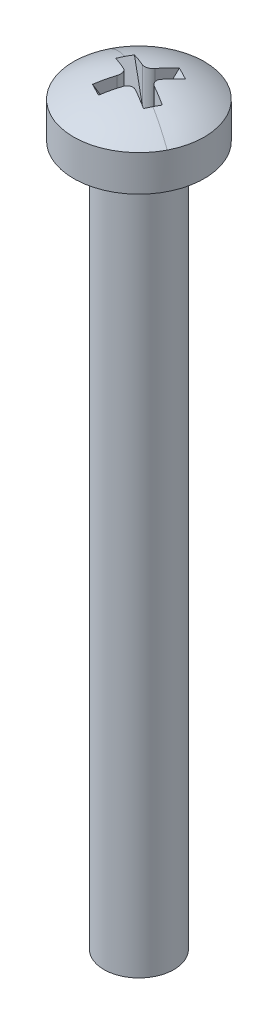
ISO-10303-21;
HEADER;
FILE_DESCRIPTION(('STEP AP214'),'2;1');
FILE_NAME('part.step','',(''),(''),'','','');
FILE_SCHEMA(('AUTOMOTIVE_DESIGN { 1 0 10303 214 1 1 1 1 }'));
ENDSEC;
DATA;
#1=APPLICATION_CONTEXT('core data for automotive mechanical design processes');
#2=APPLICATION_PROTOCOL_DEFINITION('international standard','automotive_design',2000,#1);
#3=PRODUCT_CONTEXT('',#1,'mechanical');
#4=PRODUCT('Part','Part','',(#3));
#5=PRODUCT_RELATED_PRODUCT_CATEGORY('part','',(#4));
#6=PRODUCT_DEFINITION_FORMATION('','',#4);
#7=PRODUCT_DEFINITION_CONTEXT('part definition',#1,'design');
#8=PRODUCT_DEFINITION('design','',#6,#7);
#9=PRODUCT_DEFINITION_SHAPE('','',#8);
#10=(LENGTH_UNIT() NAMED_UNIT(*) SI_UNIT(.MILLI.,.METRE.));
#11=(NAMED_UNIT(*) PLANE_ANGLE_UNIT() SI_UNIT($,.RADIAN.));
#12=(NAMED_UNIT(*) SI_UNIT($,.STERADIAN.) SOLID_ANGLE_UNIT());
#13=UNCERTAINTY_MEASURE_WITH_UNIT(LENGTH_MEASURE(1.E-05),#10,'distance_accuracy_value','');
#14=(GEOMETRIC_REPRESENTATION_CONTEXT(3) GLOBAL_UNCERTAINTY_ASSIGNED_CONTEXT((#13)) GLOBAL_UNIT_ASSIGNED_CONTEXT((#10,
#11,#12)) REPRESENTATION_CONTEXT('',''));
#15=CARTESIAN_POINT('',(0.,0.,0.));
#16=DIRECTION('',(0.,0.,1.));
#17=DIRECTION('',(1.,0.,0.));
#18=AXIS2_PLACEMENT_3D('',#15,#16,#17);
#19=CARTESIAN_POINT('',(-5.7312153497481,45.5704195270786,83.1039085041194));
#20=DIRECTION('',(0.,-1.,0.));
#21=DIRECTION('',(1.,0.,0.));
#22=AXIS2_PLACEMENT_3D('',#19,#20,#21);
#23=PLANE('',#22);
#24=DIRECTION('',(-0.45678408331748,0.,0.889577597080665));
#25=VECTOR('',#24,1.);
#26=CARTESIAN_POINT('',(-5.24871923517746,45.5704195270786,82.6678902764426));
#27=LINE('',#26,#25);
#28=CARTESIAN_POINT('',(-5.24871923517746,45.5704195270786,82.6678902764426));
#29=VERTEX_POINT('',#28);
#30=CARTESIAN_POINT('',(-5.53034360820366,45.5704195270786,83.2163479442678));
#31=VERTEX_POINT('',#30);
#32=EDGE_CURVE('E144',#29,#31,#27,.T.);
#33=ORIENTED_EDGE('',*,*,#32,.F.);
#34=CARTESIAN_POINT('',(-5.05323639563817,45.5704195270786,82.4403238917421));
#35=DIRECTION('',(0.,-1.,0.));
#36=DIRECTION('',(1.,0.,0.));
#37=AXIS2_PLACEMENT_3D('',#34,#35,#36);
#38=CIRCLE('',#37,0.299999999999998);
#39=CARTESIAN_POINT('',(-5.34470545960922,45.5704195270786,82.3692902043266));
#40=VERTEX_POINT('',#39);
#41=EDGE_CURVE('E324',#40,#29,#38,.F.);
#42=ORIENTED_EDGE('',*,*,#41,.F.);
#43=DIRECTION('',(0.889577597080659,0.,0.456784083317492));
#44=VECTOR('',#43,1.);
#45=CARTESIAN_POINT('',(-5.89316312743447,45.5704195270786,82.0876658313004));
#46=LINE('',#45,#44);
#47=CARTESIAN_POINT('',(-5.89316312743446,45.5704195270786,82.0876658313004));
#48=VERTEX_POINT('',#47);
#49=EDGE_CURVE('E170',#48,#40,#46,.T.);
#50=ORIENTED_EDGE('',*,*,#49,.F.);
#51=CARTESIAN_POINT('',(-6.12072951213497,45.5704195270786,81.8921829917611));
#52=DIRECTION('',(0.,-1.,0.));
#53=DIRECTION('',(1.,0.,0.));
#54=AXIS2_PLACEMENT_3D('',#51,#52,#53);
#55=CIRCLE('',#54,0.299999999999998);
#56=CARTESIAN_POINT('',(-6.19176319955046,45.5704195270786,82.1836520557322));
#57=VERTEX_POINT('',#56);
#58=EDGE_CURVE('E342',#57,#48,#55,.F.);
#59=ORIENTED_EDGE('',*,*,#58,.F.);
#60=DIRECTION('',(0.456784083317476,0.,-0.889577597080667));
#61=VECTOR('',#60,1.);
#62=CARTESIAN_POINT('',(-6.47338757257667,45.5704195270786,82.7321097235574));
#63=LINE('',#62,#61);
#64=CARTESIAN_POINT('',(-6.47338757257666,45.5704195270786,82.7321097235574));
#65=VERTEX_POINT('',#64);
#66=EDGE_CURVE('E174',#65,#57,#63,.T.);
#67=ORIENTED_EDGE('',*,*,#66,.F.);
#68=CARTESIAN_POINT('',(-6.66887041211595,45.5704195270786,82.9596761082579));
#69=DIRECTION('',(0.,-1.,0.));
#70=DIRECTION('',(1.,0.,0.));
#71=AXIS2_PLACEMENT_3D('',#68,#69,#70);
#72=CIRCLE('',#71,0.299999999999998);
#73=CARTESIAN_POINT('',(-6.3774013481449,45.5704195270786,83.0307097956734));
#74=VERTEX_POINT('',#73);
#75=EDGE_CURVE('E379',#74,#65,#72,.F.);
#76=ORIENTED_EDGE('',*,*,#75,.F.);
#77=DIRECTION('',(-0.88957759708066,0.,-0.45678408331749));
#78=VECTOR('',#77,1.);
#79=CARTESIAN_POINT('',(-5.82894368031965,45.5704195270786,83.3123341686996));
#80=LINE('',#79,#78);
#81=CARTESIAN_POINT('',(-5.82894368031965,45.5704195270786,83.3123341686996));
#82=VERTEX_POINT('',#81);
#83=EDGE_CURVE('E147',#82,#74,#80,.T.);
#84=ORIENTED_EDGE('',*,*,#83,.F.);
#85=CARTESIAN_POINT('',(-5.60137729561915,45.5704195270786,83.5078170082389));
#86=DIRECTION('',(0.,-1.,0.));
#87=DIRECTION('',(1.,0.,0.));
#88=AXIS2_PLACEMENT_3D('',#85,#86,#87);
#89=CIRCLE('',#88,0.299999999999998);
#90=EDGE_CURVE('E21',#31,#82,#89,.F.);
#91=ORIENTED_EDGE('',*,*,#90,.F.);
#92=EDGE_LOOP('',(#33,#42,#50,#59,#67,#76,#84,#91));
#93=FACE_BOUND('',#92,.T.);
#94=ADVANCED_FACE('F18',(#93),#23,.F.);
#95=CARTESIAN_POINT('',(-5.60137729561915,45.5704195270786,83.5078170082389));
#96=DIRECTION('',(0.,-1.,0.));
#97=DIRECTION('',(1.,0.,0.));
#98=AXIS2_PLACEMENT_3D('',#95,#96,#97);
#99=CYLINDRICAL_SURFACE('',#98,0.299999999999998);
#100=DIRECTION('',(0.,1.,0.));
#101=VECTOR('',#100,1.);
#102=CARTESIAN_POINT('',(-5.86825057474334,45.5704195270786,83.3707817832436));
#103=LINE('',#102,#101);
#104=CARTESIAN_POINT('',(-5.86825057474346,47.2052151838135,83.3707817832439));
#105=VERTEX_POINT('',#104);
#106=CARTESIAN_POINT('',(-5.86825057474334,45.6915738002666,83.3707817832436));
#107=VERTEX_POINT('',#106);
#108=EDGE_CURVE('E471',#105,#107,#103,.F.);
#109=ORIENTED_EDGE('',*,*,#108,.F.);
#110=CARTESIAN_POINT('',(-5.86825057474357,47.2052151838135,83.3707817832441));
#111=CARTESIAN_POINT('',(-5.8606356569211,47.2072391497238,83.3559197222575));
#112=CARTESIAN_POINT('',(-5.85174572056607,47.2090920081056,83.3416898597908));
#113=CARTESIAN_POINT('',(-5.83170765889238,47.2124095103203,83.3148777604995));
#114=CARTESIAN_POINT('',(-5.82056040596617,47.2138743036266,83.30229489024));
#115=CARTESIAN_POINT('',(-5.796283571488,47.2163723024023,83.2791387331639));
#116=CARTESIAN_POINT('',(-5.78315241742198,47.2174051630366,83.2685670556464));
#117=CARTESIAN_POINT('',(-5.75529161487819,47.2190067962014,83.2497616227291));
#118=CARTESIAN_POINT('',(-5.74056249345227,47.2195757212261,83.2415270996949));
#119=CARTESIAN_POINT('',(-5.71004315582194,47.2202300218207,83.2276914439236));
#120=CARTESIAN_POINT('',(-5.69426202632533,47.2203191028308,83.2220704386826));
#121=CARTESIAN_POINT('',(-5.66198923851337,47.2200210020274,83.2135301553134));
#122=CARTESIAN_POINT('',(-5.64549759508667,47.2196338301889,83.2106108206013));
#123=CARTESIAN_POINT('',(-5.61233310136362,47.2183971460226,83.2075563558061));
#124=CARTESIAN_POINT('',(-5.59566103977049,47.2175491814301,83.2074119638093));
#125=CARTESIAN_POINT('',(-5.56255211634217,47.2154168278946,83.2098776194737));
#126=CARTESIAN_POINT('',(-5.54611517161982,47.2141325969105,83.2124866709154));
#127=CARTESIAN_POINT('',(-5.51862531492014,47.2115984533834,83.219216583073));
#128=CARTESIAN_POINT('',(-5.5073967023964,47.2104471601799,83.2226771820593));
#129=CARTESIAN_POINT('',(-5.48545342755952,47.2079631810633,83.2308713279406));
#130=CARTESIAN_POINT('',(-5.47473805166186,47.2066307575083,83.2356030431908));
#131=CARTESIAN_POINT('',(-5.46434207062389,47.2052151838136,83.2409437291147));
#132=B_SPLINE_CURVE_WITH_KNOTS('',3,(#110,#111,#112,#113,#114,#115,#116,#117,#118,#119,#120,
#121,#122,#123,#124,#125,#126,#127,#128,#129,#130,#131),.UNSPECIFIED.,.F.,.F.,(4,2,2,2,2,2,2,2,
2,2,4),(0.,0.0504039946641224,0.100788546583111,0.151213246756512,0.201621365804838,
0.251639660452705,0.301656907488691,0.351507183085324,0.401339428604883,0.436680554237729,
0.47197102490866),.UNSPECIFIED.);
#133=CARTESIAN_POINT('',(-5.4643420706239,47.2052151838136,83.2409437291147));
#134=VERTEX_POINT('',#133);
#135=EDGE_CURVE('E150',#105,#134,#132,.T.);
#136=ORIENTED_EDGE('',*,*,#135,.T.);
#137=DIRECTION('',(0.,1.,0.));
#138=VECTOR('',#137,1.);
#139=CARTESIAN_POINT('',(-5.46434207062391,45.5704195270786,83.2409437291147));
#140=LINE('',#139,#138);
#141=CARTESIAN_POINT('',(-5.46434207062391,45.6915738002666,83.2409437291147));
#142=VERTEX_POINT('',#141);
#143=EDGE_CURVE('E156',#142,#134,#140,.T.);
#144=ORIENTED_EDGE('',*,*,#143,.F.);
#145=CARTESIAN_POINT('',(-5.60137729561915,45.6915738002666,83.5078170082389));
#146=DIRECTION('',(-0.770396797709373,0.500000000000001,-0.395586620197326));
#147=DIRECTION('',(-0.444788798540333,-0.866025403784438,-0.228392041658741));
#148=AXIS2_PLACEMENT_3D('',#145,#146,#147);
#149=ELLIPSE('',#148,0.599999999999995,0.299999999999998);
#150=EDGE_CURVE('E152',#31,#142,#149,.F.);
#151=ORIENTED_EDGE('',*,*,#150,.F.);
#152=ORIENTED_EDGE('',*,*,#90,.T.);
#153=CARTESIAN_POINT('',(-5.60137729561915,45.6915738002666,83.5078170082389));
#154=DIRECTION('',(0.395586620197326,0.500000000000001,-0.770396797709372));
#155=DIRECTION('',(0.228392041658741,-0.866025403784438,-0.444788798540333));
#156=AXIS2_PLACEMENT_3D('',#153,#154,#155);
#157=ELLIPSE('',#156,0.599999999999994,0.299999999999998);
#158=EDGE_CURVE('E179',#107,#82,#157,.F.);
#159=ORIENTED_EDGE('',*,*,#158,.F.);
#160=EDGE_LOOP('',(#109,#136,#144,#151,#152,#159));
#161=FACE_BOUND('',#160,.T.);
#162=ADVANCED_FACE('F154',(#161),#99,.T.);
#163=CARTESIAN_POINT('',(-6.54622952885328,47.2504195270786,84.034366395621));
#164=DIRECTION('',(0.395586620197326,0.500000000000001,-0.770396797709372));
#165=DIRECTION('',(0.,0.838820499650936,0.544408090833847));
#166=AXIS2_PLACEMENT_3D('',#163,#164,#165);
#167=PLANE('',#166);
#168=ORIENTED_EDGE('',*,*,#83,.T.);
#169=CARTESIAN_POINT('',(-6.66887041211595,45.6915738002666,82.9596761082579));
#170=DIRECTION('',(0.395586620197326,0.500000000000001,-0.770396797709372));
#171=DIRECTION('',(0.228392041658741,-0.866025403784438,-0.444788798540333));
#172=AXIS2_PLACEMENT_3D('',#169,#170,#171);
#173=ELLIPSE('',#172,0.599999999999994,0.299999999999998);
#174=CARTESIAN_POINT('',(-6.40199713299174,45.6915738002666,83.0967113332531));
#175=VERTEX_POINT('',#174);
#176=EDGE_CURVE('E178',#175,#74,#173,.T.);
#177=ORIENTED_EDGE('',*,*,#176,.F.);
#178=DIRECTION('',(0.228392041658741,-0.866025403784438,-0.444788798540333));
#179=VECTOR('',#178,1.);
#180=CARTESIAN_POINT('',(-6.75925235532959,47.0462273859704,83.7924585228743));
#181=LINE('',#180,#179);
#182=CARTESIAN_POINT('',(-6.75925235532959,47.0462273859704,83.7924585228743));
#183=VERTEX_POINT('',#182);
#184=EDGE_CURVE('E462',#183,#175,#181,.T.);
#185=ORIENTED_EDGE('',*,*,#184,.F.);
#186=CARTESIAN_POINT('',(-6.7592523553296,47.0462273859704,83.7924585228743));
#187=CARTESIAN_POINT('',(-6.67170762521174,47.0515853639129,83.8408887772387));
#188=CARTESIAN_POINT('',(-6.58345638029879,47.0542643528841,83.8879431085868));
#189=CARTESIAN_POINT('',(-6.40554086088271,47.054264352884,83.9792999252504));
#190=CARTESIAN_POINT('',(-6.31587658637957,47.0515853639128,84.0236024105658));
#191=CARTESIAN_POINT('',(-6.22550579708135,47.0462273859703,84.066528972865));
#192=B_SPLINE_CURVE_WITH_KNOTS('',3,(#186,#187,#188,#189,#190,#191),.UNSPECIFIED.,.F.,.F.,(4,2,
4),(0.,0.30014350531518,0.600287010630361),.UNSPECIFIED.);
#193=CARTESIAN_POINT('',(-6.22550579708127,47.0462273859704,84.0665289728649));
#194=VERTEX_POINT('',#193);
#195=EDGE_CURVE('E384',#183,#194,#192,.T.);
#196=ORIENTED_EDGE('',*,*,#195,.T.);
#197=DIRECTION('',(-0.228392041658738,0.866025403784442,0.444788798540327));
#198=VECTOR('',#197,1.);
#199=CARTESIAN_POINT('',(-5.86825057474334,45.6915738002666,83.3707817832436));
#200=LINE('',#199,#198);
#201=EDGE_CURVE('E468',#107,#194,#200,.T.);
#202=ORIENTED_EDGE('',*,*,#201,.F.);
#203=ORIENTED_EDGE('',*,*,#158,.T.);
#204=EDGE_LOOP('',(#168,#177,#185,#196,#202,#203));
#205=FACE_BOUND('',#204,.T.);
#206=ADVANCED_FACE('F393',(#205),#167,.T.);
#207=CARTESIAN_POINT('',(-6.66887041211595,45.5704195270786,82.9596761082579));
#208=DIRECTION('',(0.,-1.,0.));
#209=DIRECTION('',(1.,0.,0.));
#210=AXIS2_PLACEMENT_3D('',#207,#208,#209);
#211=CYLINDRICAL_SURFACE('',#210,0.299999999999998);
#212=DIRECTION('',(0.,1.,0.));
#213=VECTOR('',#212,1.);
#214=CARTESIAN_POINT('',(-6.53183518712071,45.5704195270786,82.6928028291337));
#215=LINE('',#214,#213);
#216=CARTESIAN_POINT('',(-6.5318351871207,47.2052151838136,82.6928028291337));
#217=VERTEX_POINT('',#216);
#218=CARTESIAN_POINT('',(-6.53183518712071,45.6915738002666,82.6928028291337));
#219=VERTEX_POINT('',#218);
#220=EDGE_CURVE('E459',#217,#219,#215,.F.);
#221=ORIENTED_EDGE('',*,*,#220,.F.);
#222=CARTESIAN_POINT('',(-6.5318351871207,47.2052151838136,82.6928028291337));
#223=CARTESIAN_POINT('',(-6.5169731261341,47.2072391497239,82.7004177469562));
#224=CARTESIAN_POINT('',(-6.50274326366748,47.2090920081056,82.7093076833113));
#225=CARTESIAN_POINT('',(-6.47593116437618,47.2124095103203,82.729345744985));
#226=CARTESIAN_POINT('',(-6.46334829411669,47.2138743036267,82.7404929979112));
#227=CARTESIAN_POINT('',(-6.44019213704063,47.2163723024024,82.7647698323894));
#228=CARTESIAN_POINT('',(-6.42962045952314,47.2174051630366,82.7779009864555));
#229=CARTESIAN_POINT('',(-6.41081502660594,47.2190067962014,82.8057617889993));
#230=CARTESIAN_POINT('',(-6.40258050357175,47.2195757212261,82.8204909104253));
#231=CARTESIAN_POINT('',(-6.38874484780055,47.2202300218208,82.8510102480556));
#232=CARTESIAN_POINT('',(-6.38312384255945,47.2203191028308,82.8667913775522));
#233=CARTESIAN_POINT('',(-6.37458355919038,47.2200210020273,82.8990641653642));
#234=CARTESIAN_POINT('',(-6.37166422447833,47.2196338301889,82.9155558087909));
#235=CARTESIAN_POINT('',(-6.36860975968318,47.2183971460226,82.948720302514));
#236=CARTESIAN_POINT('',(-6.36846536768637,47.2175491814301,82.9653923641071));
#237=CARTESIAN_POINT('',(-6.37093102335083,47.2154168278946,82.9985012875354));
#238=CARTESIAN_POINT('',(-6.37354007479258,47.2141325969105,83.0149382322577));
#239=CARTESIAN_POINT('',(-6.3802699869503,47.2115984533834,83.0424280889574));
#240=CARTESIAN_POINT('',(-6.38373058593661,47.2104471601799,83.0536567014811));
#241=CARTESIAN_POINT('',(-6.39192473181781,47.2079631810633,83.075599976318));
#242=CARTESIAN_POINT('',(-6.39665644706808,47.2066307575083,83.0863153522157));
#243=CARTESIAN_POINT('',(-6.40199713299196,47.2052151838135,83.0967113332536));
#244=B_SPLINE_CURVE_WITH_KNOTS('',3,(#222,#223,#224,#225,#226,#227,#228,#229,#230,#231,#232,
#233,#234,#235,#236,#237,#238,#239,#240,#241,#242,#243),.UNSPECIFIED.,.F.,.F.,(4,2,2,2,2,2,2,2,
2,2,4),(0.,0.0504039946641602,0.100788546583156,0.151213246756544,0.201621365804877,
0.25163966045276,0.301656907488742,0.351507183085344,0.401339428604898,0.436680554237757,
0.471971024908696),.UNSPECIFIED.);
#245=CARTESIAN_POINT('',(-6.40199713299186,47.2052151838135,83.0967113332533));
#246=VERTEX_POINT('',#245);
#247=EDGE_CURVE('E373',#217,#246,#244,.T.);
#248=ORIENTED_EDGE('',*,*,#247,.T.);
#249=DIRECTION('',(0.,1.,0.));
#250=VECTOR('',#249,1.);
#251=CARTESIAN_POINT('',(-6.40199713299174,45.5704195270786,83.0967113332531));
#252=LINE('',#251,#250);
#253=EDGE_CURVE('E465',#175,#246,#252,.T.);
#254=ORIENTED_EDGE('',*,*,#253,.F.);
#255=ORIENTED_EDGE('',*,*,#176,.T.);
#256=ORIENTED_EDGE('',*,*,#75,.T.);
#257=CARTESIAN_POINT('',(-6.66887041211595,45.6915738002666,82.9596761082579));
#258=DIRECTION('',(0.770396797709372,0.500000000000001,0.395586620197326));
#259=DIRECTION('',(0.444788798540333,-0.866025403784438,0.228392041658741));
#260=AXIS2_PLACEMENT_3D('',#257,#258,#259);
#261=ELLIPSE('',#260,0.599999999999994,0.299999999999998);
#262=EDGE_CURVE('E177',#219,#65,#261,.F.);
#263=ORIENTED_EDGE('',*,*,#262,.F.);
#264=EDGE_LOOP('',(#221,#248,#254,#255,#256,#263));
#265=FACE_BOUND('',#264,.T.);
#266=ADVANCED_FACE('F353',(#265),#211,.T.);
#267=CARTESIAN_POINT('',(-7.19541979949806,47.2504195270786,82.0148238750238));
#268=DIRECTION('',(0.770396797709372,0.500000000000001,0.395586620197326));
#269=DIRECTION('',(-0.544408090833847,0.838820499650936,0.));
#270=AXIS2_PLACEMENT_3D('',#267,#268,#269);
#271=PLANE('',#270);
#272=CARTESIAN_POINT('',(-6.12072951213497,45.6915738002666,81.8921829917611));
#273=DIRECTION('',(0.770396797709372,0.500000000000001,0.395586620197326));
#274=DIRECTION('',(0.444788798540333,-0.866025403784438,0.228392041658741));
#275=AXIS2_PLACEMENT_3D('',#272,#273,#274);
#276=ELLIPSE('',#275,0.599999999999994,0.299999999999998);
#277=CARTESIAN_POINT('',(-6.25776473713021,45.6915738002666,82.1590562708853));
#278=VERTEX_POINT('',#277);
#279=EDGE_CURVE('E176',#278,#57,#276,.T.);
#280=ORIENTED_EDGE('',*,*,#279,.F.);
#281=DIRECTION('',(0.444788798540332,-0.86602540378444,0.228392041658738));
#282=VECTOR('',#281,1.);
#283=CARTESIAN_POINT('',(-6.95351192675138,47.0462273859704,81.8018010485475));
#284=LINE('',#283,#282);
#285=CARTESIAN_POINT('',(-6.95351192675138,47.0462273859704,81.8018010485475));
#286=VERTEX_POINT('',#285);
#287=EDGE_CURVE('E450',#286,#278,#284,.T.);
#288=ORIENTED_EDGE('',*,*,#287,.F.);
#289=CARTESIAN_POINT('',(-6.95351192675138,47.0462273859704,81.8018010485475));
#290=CARTESIAN_POINT('',(-6.97770503911477,47.0489060546439,81.8455309450389));
#291=CARTESIAN_POINT('',(-7.00156517813349,47.0509151362235,81.8894587045128));
#292=CARTESIAN_POINT('',(-7.04861950948159,47.0535941251947,81.9777099494258));
#293=CARTESIAN_POINT('',(-7.07181370181097,47.0542640325863,82.0220334348648));
#294=CARTESIAN_POINT('',(-7.09467492079568,47.054264352884,82.0665547832863));
#295=B_SPLINE_CURVE_WITH_KNOTS('',3,(#289,#290,#291,#292,#293,#294),.UNSPECIFIED.,.F.,.F.,(4,2,
4),(0.,0.150089694038869,0.300179388077748),.UNSPECIFIED.);
#296=CARTESIAN_POINT('',(-7.09467492079568,47.054264352884,82.0665547832863));
#297=VERTEX_POINT('',#296);
#298=EDGE_CURVE('E366',#286,#297,#295,.T.);
#299=ORIENTED_EDGE('',*,*,#298,.T.);
#300=CARTESIAN_POINT('',(-7.09467492079568,47.054264352884,82.0665547832863));
#301=CARTESIAN_POINT('',(-7.11753581077196,47.0542640325864,82.1110763006485));
#302=CARTESIAN_POINT('',(-7.14004187708895,47.0535941251947,82.1557531279554));
#303=CARTESIAN_POINT('',(-7.18434436240436,47.0509151362235,82.2454174024586));
#304=CARTESIAN_POINT('',(-7.20614078140278,47.0489060546439,82.2904048496548));
#305=CARTESIAN_POINT('',(-7.22758237674191,47.0462273859704,82.3355476067958));
#306=B_SPLINE_CURVE_WITH_KNOTS('',3,(#300,#301,#302,#303,#304,#305),.UNSPECIFIED.,.F.,.F.,(4,2,
4),(0.,0.150089694038871,0.30017938807773),.UNSPECIFIED.);
#307=CARTESIAN_POINT('',(-7.22758237674189,47.0462273859704,82.3355476067958));
#308=VERTEX_POINT('',#307);
#309=EDGE_CURVE('E359',#297,#308,#306,.T.);
#310=ORIENTED_EDGE('',*,*,#309,.T.);
#311=DIRECTION('',(-0.444788798540329,0.866025403784441,-0.228392041658738));
#312=VECTOR('',#311,1.);
#313=CARTESIAN_POINT('',(-6.53183518712071,45.6915738002666,82.6928028291337));
#314=LINE('',#313,#312);
#315=EDGE_CURVE('E456',#219,#308,#314,.T.);
#316=ORIENTED_EDGE('',*,*,#315,.F.);
#317=ORIENTED_EDGE('',*,*,#262,.T.);
#318=ORIENTED_EDGE('',*,*,#66,.T.);
#319=EDGE_LOOP('',(#280,#288,#299,#310,#316,#317,#318));
#320=FACE_BOUND('',#319,.T.);
#321=ADVANCED_FACE('F348',(#320),#271,.T.);
#322=CARTESIAN_POINT('',(-6.12072951213497,45.5704195270786,81.8921829917611));
#323=DIRECTION('',(0.,-1.,0.));
#324=DIRECTION('',(1.,0.,0.));
#325=AXIS2_PLACEMENT_3D('',#322,#323,#324);
#326=CYLINDRICAL_SURFACE('',#325,0.299999999999998);
#327=DIRECTION('',(0.,1.,0.));
#328=VECTOR('',#327,1.);
#329=CARTESIAN_POINT('',(-5.85385623301077,45.5704195270786,82.0292182167563));
#330=LINE('',#329,#328);
#331=CARTESIAN_POINT('',(-5.85385623301066,47.2052151838135,82.0292182167561));
#332=VERTEX_POINT('',#331);
#333=CARTESIAN_POINT('',(-5.85385623301077,45.6915738002666,82.0292182167563));
#334=VERTEX_POINT('',#333);
#335=EDGE_CURVE('E447',#332,#334,#330,.F.);
#336=ORIENTED_EDGE('',*,*,#335,.F.);
#337=CARTESIAN_POINT('',(-5.85385623301054,47.2052151838135,82.0292182167559));
#338=CARTESIAN_POINT('',(-5.86147115083302,47.2072391497238,82.0440802777425));
#339=CARTESIAN_POINT('',(-5.87036108718805,47.2090920081056,82.0583101402092));
#340=CARTESIAN_POINT('',(-5.89039914886175,47.2124095103203,82.0851222395005));
#341=CARTESIAN_POINT('',(-5.90154640178795,47.2138743036267,82.09770510976));
#342=CARTESIAN_POINT('',(-5.92582323626612,47.2163723024023,82.1208612668361));
#343=CARTESIAN_POINT('',(-5.93895439033213,47.2174051630366,82.1314329443536));
#344=CARTESIAN_POINT('',(-5.96681519287594,47.2190067962014,82.1502383772708));
#345=CARTESIAN_POINT('',(-5.98154431430189,47.2195757212261,82.158472900305));
#346=CARTESIAN_POINT('',(-6.01206365193223,47.2202300218207,82.1723085560763));
#347=CARTESIAN_POINT('',(-6.02784478142883,47.2203191028308,82.1779295613174));
#348=CARTESIAN_POINT('',(-6.06011756924077,47.2200210020274,82.1864698446866));
#349=CARTESIAN_POINT('',(-6.07660921266747,47.2196338301889,82.1893891793987));
#350=CARTESIAN_POINT('',(-6.10977370639052,47.2183971460226,82.1924436441939));
#351=CARTESIAN_POINT('',(-6.12644576798365,47.2175491814301,82.1925880361907));
#352=CARTESIAN_POINT('',(-6.15955469141196,47.2154168278946,82.1901223805263));
#353=CARTESIAN_POINT('',(-6.17599163613431,47.2141325969105,82.1875133290846));
#354=CARTESIAN_POINT('',(-6.20348149283399,47.2115984533834,82.1807834169269));
#355=CARTESIAN_POINT('',(-6.21471010535773,47.2104471601799,82.1773228179406));
#356=CARTESIAN_POINT('',(-6.23665338019461,47.2079631810633,82.1691286720595));
#357=CARTESIAN_POINT('',(-6.24736875609226,47.2066307575083,82.1643969568092));
#358=CARTESIAN_POINT('',(-6.25776473713021,47.2052151838136,82.1590562708853));
#359=B_SPLINE_CURVE_WITH_KNOTS('',3,(#337,#338,#339,#340,#341,#342,#343,#344,#345,#346,#347,
#348,#349,#350,#351,#352,#353,#354,#355,#356,#357,#358),.UNSPECIFIED.,.F.,.F.,(4,2,2,2,2,2,2,2,
2,2,4),(0.,0.0504039946641595,0.100788546583139,0.151213246756522,0.201621365804842,
0.251639660452726,0.301656907488703,0.351507183085331,0.401339428604902,0.436680554237732,
0.471971024908636),.UNSPECIFIED.);
#360=CARTESIAN_POINT('',(-6.2577647371302,47.2052151838136,82.1590562708853));
#361=VERTEX_POINT('',#360);
#362=EDGE_CURVE('E336',#332,#361,#359,.T.);
#363=ORIENTED_EDGE('',*,*,#362,.T.);
#364=DIRECTION('',(0.,1.,0.));
#365=VECTOR('',#364,1.);
#366=CARTESIAN_POINT('',(-6.25776473713021,45.5704195270786,82.1590562708853));
#367=LINE('',#366,#365);
#368=EDGE_CURVE('E453',#278,#361,#367,.T.);
#369=ORIENTED_EDGE('',*,*,#368,.F.);
#370=ORIENTED_EDGE('',*,*,#279,.T.);
#371=ORIENTED_EDGE('',*,*,#58,.T.);
#372=CARTESIAN_POINT('',(-6.12072951213497,45.6915738002666,81.8921829917611));
#373=DIRECTION('',(-0.395586620197326,0.500000000000001,0.770396797709372));
#374=DIRECTION('',(-0.228392041658741,-0.866025403784438,0.444788798540333));
#375=AXIS2_PLACEMENT_3D('',#372,#373,#374);
#376=ELLIPSE('',#375,0.599999999999995,0.299999999999998);
#377=EDGE_CURVE('E173',#334,#48,#376,.F.);
#378=ORIENTED_EDGE('',*,*,#377,.F.);
#379=EDGE_LOOP('',(#336,#363,#369,#370,#371,#378));
#380=FACE_BOUND('',#379,.T.);
#381=ADVANCED_FACE('F344',(#380),#326,.T.);
#382=CARTESIAN_POINT('',(-5.17587727890084,47.2504195270786,81.365633604379));
#383=DIRECTION('',(-0.395586620197326,0.500000000000001,0.770396797709372));
#384=DIRECTION('',(0.,-0.838820499650936,0.544408090833847));
#385=AXIS2_PLACEMENT_3D('',#382,#383,#384);
#386=PLANE('',#385);
#387=ORIENTED_EDGE('',*,*,#49,.T.);
#388=CARTESIAN_POINT('',(-5.05323639563817,45.6915738002666,82.4403238917421));
#389=DIRECTION('',(-0.395586620197326,0.500000000000001,0.770396797709372));
#390=DIRECTION('',(-0.228392041658741,-0.866025403784438,0.444788798540333));
#391=AXIS2_PLACEMENT_3D('',#388,#389,#390);
#392=ELLIPSE('',#391,0.599999999999995,0.299999999999998);
#393=CARTESIAN_POINT('',(-5.32010967476237,45.6915738002666,82.3032886667468));
#394=VERTEX_POINT('',#393);
#395=EDGE_CURVE('E172',#394,#40,#392,.T.);
#396=ORIENTED_EDGE('',*,*,#395,.F.);
#397=DIRECTION('',(-0.228392041658737,-0.866025403784442,0.444788798540327));
#398=VECTOR('',#397,1.);
#399=CARTESIAN_POINT('',(-4.96285445242453,47.0462273859704,81.6075414771257));
#400=LINE('',#399,#398);
#401=CARTESIAN_POINT('',(-4.96285445242452,47.0462273859704,81.6075414771257));
#402=VERTEX_POINT('',#401);
#403=EDGE_CURVE('E438',#402,#394,#400,.T.);
#404=ORIENTED_EDGE('',*,*,#403,.F.);
#405=CARTESIAN_POINT('',(-4.96285445242452,47.0462273859704,81.6075414771257));
#406=CARTESIAN_POINT('',(-5.05039918254237,47.0515853639128,81.5591112227613));
#407=CARTESIAN_POINT('',(-5.13865042745532,47.0542643528841,81.5120568914132));
#408=CARTESIAN_POINT('',(-5.3165659468714,47.054264352884,81.4207000747496));
#409=CARTESIAN_POINT('',(-5.40623022137454,47.0515853639128,81.3763975894341));
#410=CARTESIAN_POINT('',(-5.49660101067277,47.0462273859703,81.333471027135));
#411=B_SPLINE_CURVE_WITH_KNOTS('',3,(#405,#406,#407,#408,#409,#410),.UNSPECIFIED.,.F.,.F.,(4,2,
4),(0.,0.300143505315175,0.600287010630354),.UNSPECIFIED.);
#412=CARTESIAN_POINT('',(-5.49660101067284,47.0462273859704,81.3334710271351));
#413=VERTEX_POINT('',#412);
#414=EDGE_CURVE('E330',#402,#413,#411,.T.);
#415=ORIENTED_EDGE('',*,*,#414,.T.);
#416=DIRECTION('',(0.228392041658741,0.866025403784438,-0.444788798540333));
#417=VECTOR('',#416,1.);
#418=CARTESIAN_POINT('',(-5.85385623301077,45.6915738002666,82.0292182167563));
#419=LINE('',#418,#417);
#420=EDGE_CURVE('E444',#334,#413,#419,.T.);
#421=ORIENTED_EDGE('',*,*,#420,.F.);
#422=ORIENTED_EDGE('',*,*,#377,.T.);
#423=EDGE_LOOP('',(#387,#396,#404,#415,#421,#422));
#424=FACE_BOUND('',#423,.T.);
#425=ADVANCED_FACE('F314',(#424),#386,.T.);
#426=CARTESIAN_POINT('',(-5.05323639563817,45.5704195270786,82.4403238917421));
#427=DIRECTION('',(0.,-1.,0.));
#428=DIRECTION('',(1.,0.,0.));
#429=AXIS2_PLACEMENT_3D('',#426,#427,#428);
#430=CYLINDRICAL_SURFACE('',#429,0.299999999999998);
#431=DIRECTION('',(0.,1.,0.));
#432=VECTOR('',#431,1.);
#433=CARTESIAN_POINT('',(-5.19027162063341,45.5704195270786,82.7071971708663));
#434=LINE('',#433,#432);
#435=CARTESIAN_POINT('',(-5.19027162063341,47.2052151838136,82.7071971708663));
#436=VERTEX_POINT('',#435);
#437=CARTESIAN_POINT('',(-5.19027162063341,45.6915738002666,82.7071971708663));
#438=VERTEX_POINT('',#437);
#439=EDGE_CURVE('E435',#436,#438,#434,.F.);
#440=ORIENTED_EDGE('',*,*,#439,.F.);
#441=CARTESIAN_POINT('',(-5.19027162063341,47.2052151838136,82.7071971708663));
#442=CARTESIAN_POINT('',(-5.20513368161999,47.2072391497239,82.6995822530438));
#443=CARTESIAN_POINT('',(-5.21936354408661,47.2090920081056,82.6906923166887));
#444=CARTESIAN_POINT('',(-5.24617564337793,47.2124095103203,82.670654255015));
#445=CARTESIAN_POINT('',(-5.25875851363742,47.2138743036267,82.6595070020888));
#446=CARTESIAN_POINT('',(-5.28191467071348,47.2163723024024,82.6352301676106));
#447=CARTESIAN_POINT('',(-5.29248634823096,47.2174051630366,82.6220990135445));
#448=CARTESIAN_POINT('',(-5.31129178114815,47.2190067962014,82.5942382110007));
#449=CARTESIAN_POINT('',(-5.31952630418234,47.2195757212261,82.5795090895747));
#450=CARTESIAN_POINT('',(-5.33336195995354,47.2202300218207,82.5489897519444));
#451=CARTESIAN_POINT('',(-5.33898296519464,47.2203191028308,82.5332086224478));
#452=CARTESIAN_POINT('',(-5.34752324856373,47.2200210020273,82.5009358346358));
#453=CARTESIAN_POINT('',(-5.35044258327578,47.2196338301889,82.4844441912091));
#454=CARTESIAN_POINT('',(-5.35349704807093,47.2183971460226,82.4512796974861));
#455=CARTESIAN_POINT('',(-5.35364144006775,47.2175491814301,82.434607635893));
#456=CARTESIAN_POINT('',(-5.3511757844033,47.2154168278946,82.4014987124646));
#457=CARTESIAN_POINT('',(-5.34856673296156,47.2141325969105,82.3850617677423));
#458=CARTESIAN_POINT('',(-5.34183682080385,47.2115984533834,82.3575719110426));
#459=CARTESIAN_POINT('',(-5.33837622181754,47.2104471601799,82.3463432985189));
#460=CARTESIAN_POINT('',(-5.33018207593632,47.2079631810633,82.324400023682));
#461=CARTESIAN_POINT('',(-5.32545036068604,47.2066307575083,82.3136846477844));
#462=CARTESIAN_POINT('',(-5.32010967476215,47.2052151838135,82.3032886667464));
#463=B_SPLINE_CURVE_WITH_KNOTS('',3,(#441,#442,#443,#444,#445,#446,#447,#448,#449,#450,#451,
#452,#453,#454,#455,#456,#457,#458,#459,#460,#461,#462),.UNSPECIFIED.,.F.,.F.,(4,2,2,2,2,2,2,2,
2,2,4),(0.,0.0504039946641485,0.100788546583122,0.151213246756523,0.201621365804828,
0.251639660452688,0.301656907488673,0.351507183085301,0.401339428604868,0.436680554237714,
0.471971024908639),.UNSPECIFIED.);
#464=CARTESIAN_POINT('',(-5.32010967476226,47.2052151838135,82.3032886667466));
#465=VERTEX_POINT('',#464);
#466=EDGE_CURVE('E318',#436,#465,#463,.T.);
#467=ORIENTED_EDGE('',*,*,#466,.T.);
#468=DIRECTION('',(0.,1.,0.));
#469=VECTOR('',#468,1.);
#470=CARTESIAN_POINT('',(-5.32010967476237,45.5704195270786,82.3032886667468));
#471=LINE('',#470,#469);
#472=EDGE_CURVE('E441',#394,#465,#471,.T.);
#473=ORIENTED_EDGE('',*,*,#472,.F.);
#474=ORIENTED_EDGE('',*,*,#395,.T.);
#475=ORIENTED_EDGE('',*,*,#41,.T.);
#476=CARTESIAN_POINT('',(-5.05323639563817,45.6915738002666,82.4403238917421));
#477=DIRECTION('',(-0.770396797709373,0.500000000000001,-0.395586620197326));
#478=DIRECTION('',(-0.444788798540333,-0.866025403784438,-0.228392041658741));
#479=AXIS2_PLACEMENT_3D('',#476,#477,#478);
#480=ELLIPSE('',#479,0.599999999999995,0.299999999999998);
#481=EDGE_CURVE('E163',#438,#29,#480,.F.);
#482=ORIENTED_EDGE('',*,*,#481,.F.);
#483=EDGE_LOOP('',(#440,#467,#473,#474,#475,#482));
#484=FACE_BOUND('',#483,.T.);
#485=ADVANCED_FACE('F309',(#484),#430,.T.);
#486=CARTESIAN_POINT('',(-4.52668700825606,47.2504195270786,83.3851761249762));
#487=DIRECTION('',(-0.770396797709373,0.500000000000001,-0.395586620197326));
#488=DIRECTION('',(-0.544408090833847,-0.838820499650936,0.));
#489=AXIS2_PLACEMENT_3D('',#486,#487,#488);
#490=PLANE('',#489);
#491=ORIENTED_EDGE('',*,*,#150,.T.);
#492=DIRECTION('',(-0.444788798540329,-0.866025403784441,-0.228392041658738));
#493=VECTOR('',#492,1.);
#494=CARTESIAN_POINT('',(-4.76859488100274,47.0462273859704,83.5981989514525));
#495=LINE('',#494,#493);
#496=CARTESIAN_POINT('',(-4.76859488100274,47.0462273859704,83.5981989514525));
#497=VERTEX_POINT('',#496);
#498=EDGE_CURVE('E473',#497,#142,#495,.T.);
#499=ORIENTED_EDGE('',*,*,#498,.F.);
#500=CARTESIAN_POINT('',(-4.76859488100274,47.0462273859704,83.5981989514525));
#501=CARTESIAN_POINT('',(-4.74440176863934,47.0489060546439,83.5544690549611));
#502=CARTESIAN_POINT('',(-4.72054162962062,47.0509151362235,83.5105412954872));
#503=CARTESIAN_POINT('',(-4.67348729827252,47.0535941251947,83.4222900505742));
#504=CARTESIAN_POINT('',(-4.65029310594315,47.0542640325864,83.3779665651352));
#505=CARTESIAN_POINT('',(-4.62743188695845,47.054264352884,83.3334452167137));
#506=B_SPLINE_CURVE_WITH_KNOTS('',3,(#500,#501,#502,#503,#504,#505),.UNSPECIFIED.,.F.,.F.,(4,2,
4),(0.,0.150089694038875,0.300179388077759),.UNSPECIFIED.);
#507=CARTESIAN_POINT('',(-4.62743188695846,47.054264352884,83.3334452167137));
#508=VERTEX_POINT('',#507);
#509=EDGE_CURVE('E300',#497,#508,#506,.T.);
#510=ORIENTED_EDGE('',*,*,#509,.T.);
#511=CARTESIAN_POINT('',(-4.62743188695846,47.054264352884,83.3334452167137));
#512=CARTESIAN_POINT('',(-4.60457099698217,47.0542640325864,83.2889236993515));
#513=CARTESIAN_POINT('',(-4.58206493066517,47.0535941251947,83.2442468720446));
#514=CARTESIAN_POINT('',(-4.53776244534976,47.0509151362235,83.1545825975414));
#515=CARTESIAN_POINT('',(-4.51596602635135,47.0489060546439,83.1095951503451));
#516=CARTESIAN_POINT('',(-4.49452443101222,47.0462273859704,83.0644523932041));
#517=B_SPLINE_CURVE_WITH_KNOTS('',3,(#511,#512,#513,#514,#515,#516),.UNSPECIFIED.,.F.,.F.,(4,2,
4),(0.,0.15008969403889,0.300179388077773),.UNSPECIFIED.);
#518=CARTESIAN_POINT('',(-4.49452443101224,47.0462273859704,83.0644523932041));
#519=VERTEX_POINT('',#518);
#520=EDGE_CURVE('E165',#508,#519,#517,.T.);
#521=ORIENTED_EDGE('',*,*,#520,.T.);
#522=DIRECTION('',(0.444788798540327,0.866025403784442,0.228392041658738));
#523=VECTOR('',#522,1.);
#524=CARTESIAN_POINT('',(-5.19027162063341,45.6915738002666,82.7071971708663));
#525=LINE('',#524,#523);
#526=EDGE_CURVE('E293',#438,#519,#525,.T.);
#527=ORIENTED_EDGE('',*,*,#526,.F.);
#528=ORIENTED_EDGE('',*,*,#481,.T.);
#529=ORIENTED_EDGE('',*,*,#32,.T.);
#530=EDGE_LOOP('',(#491,#499,#510,#521,#527,#528,#529));
#531=FACE_BOUND('',#530,.T.);
#532=ADVANCED_FACE('F161',(#531),#490,.T.);
#533=CARTESIAN_POINT('',(-5.7312153497481,45.5704195270786,83.1039085041194));
#534=DIRECTION('',(0.456784083317481,0.,-0.889577597080664));
#535=DIRECTION('',(-0.889577597080664,0.,-0.456784083317481));
#536=AXIS2_PLACEMENT_3D('',#533,#534,#535);
#537=PLANE('',#536);
#538=CARTESIAN_POINT('',(-4.76859488100275,47.0462273859704,83.5981989514526));
#539=CARTESIAN_POINT('',(-4.88266503436871,47.0831642737427,83.5396257245523));
#540=CARTESIAN_POINT('',(-4.99767904352011,47.1148817007824,83.4805678425741));
#541=CARTESIAN_POINT('',(-5.22959477339383,47.1678776333968,83.3614827684614));
#542=CARTESIAN_POINT('',(-5.34649649411614,47.1891561389715,83.3014555763271));
#543=CARTESIAN_POINT('',(-5.4643420706239,47.2052151838136,83.2409437291147));
#544=B_SPLINE_CURVE_WITH_KNOTS('',3,(#538,#539,#540,#541,#542,#543),.UNSPECIFIED.,.F.,.F.,(4,2,
4),(0.,0.399372580588287,0.798745161176576),.UNSPECIFIED.);
#545=EDGE_CURVE('E287',#497,#134,#544,.T.);
#546=ORIENTED_EDGE('',*,*,#545,.F.);
#547=ORIENTED_EDGE('',*,*,#498,.T.);
#548=ORIENTED_EDGE('',*,*,#143,.T.);
#549=EDGE_LOOP('',(#546,#547,#548));
#550=FACE_BOUND('',#549,.T.);
#551=ADVANCED_FACE('F276',(#550),#537,.T.);
#552=CARTESIAN_POINT('',(-5.7312153497481,45.5704195270786,83.1039085041194));
#553=DIRECTION('',(-0.889577597080664,0.,-0.456784083317481));
#554=DIRECTION('',(-0.456784083317481,0.,0.889577597080664));
#555=AXIS2_PLACEMENT_3D('',#552,#553,#554);
#556=PLANE('',#555);
#557=ORIENTED_EDGE('',*,*,#201,.T.);
#558=CARTESIAN_POINT('',(-5.86825057474357,47.2052151838135,83.3707817832441));
#559=CARTESIAN_POINT('',(-5.92876242195592,47.1891561389714,83.4886273597517));
#560=CARTESIAN_POINT('',(-5.98878961409023,47.1678776333968,83.605529080474));
#561=CARTESIAN_POINT('',(-6.10787468820276,47.1148817007824,83.8374448103475));
#562=CARTESIAN_POINT('',(-6.16693257018097,47.0831642737427,83.9524588194988));
#563=CARTESIAN_POINT('',(-6.22550579708115,47.0462273859705,84.0665289728647));
#564=B_SPLINE_CURVE_WITH_KNOTS('',3,(#558,#559,#560,#561,#562,#563),.UNSPECIFIED.,.F.,.F.,(4,2,
4),(0.,0.399372580588009,0.798745161175991),.UNSPECIFIED.);
#565=EDGE_CURVE('E280',#105,#194,#564,.T.);
#566=ORIENTED_EDGE('',*,*,#565,.F.);
#567=ORIENTED_EDGE('',*,*,#108,.T.);
#568=EDGE_LOOP('',(#557,#566,#567));
#569=FACE_BOUND('',#568,.T.);
#570=ADVANCED_FACE('F271',(#569),#556,.T.);
#571=CARTESIAN_POINT('',(-6.2649619079965,45.5704195270786,82.829838054129));
#572=DIRECTION('',(0.889577597080664,0.,0.456784083317481));
#573=DIRECTION('',(0.456784083317481,0.,-0.889577597080664));
#574=AXIS2_PLACEMENT_3D('',#571,#572,#573);
#575=PLANE('',#574);
#576=CARTESIAN_POINT('',(-6.7592523553296,47.0462273859704,83.7924585228744));
#577=CARTESIAN_POINT('',(-6.70067912842944,47.0831642737427,83.6783883695085));
#578=CARTESIAN_POINT('',(-6.64162124645123,47.1148817007824,83.5633743603572));
#579=CARTESIAN_POINT('',(-6.52253617233872,47.1678776333967,83.3314586304837));
#580=CARTESIAN_POINT('',(-6.46250898020442,47.1891561389714,83.2145569097614));
#581=CARTESIAN_POINT('',(-6.40199713299208,47.2052151838135,83.0967113332538));
#582=B_SPLINE_CURVE_WITH_KNOTS('',3,(#576,#577,#578,#579,#580,#581),.UNSPECIFIED.,.F.,.F.,(4,2,
4),(0.,0.399372580587945,0.798745161175902),.UNSPECIFIED.);
#583=EDGE_CURVE('E256',#183,#246,#582,.T.);
#584=ORIENTED_EDGE('',*,*,#583,.F.);
#585=ORIENTED_EDGE('',*,*,#184,.T.);
#586=ORIENTED_EDGE('',*,*,#253,.T.);
#587=EDGE_LOOP('',(#584,#585,#586));
#588=FACE_BOUND('',#587,.T.);
#589=ADVANCED_FACE('F266',(#588),#575,.T.);
#590=CARTESIAN_POINT('',(-6.2649619079965,45.5704195270786,82.829838054129));
#591=DIRECTION('',(0.456784083317481,0.,-0.889577597080664));
#592=DIRECTION('',(-0.889577597080664,0.,-0.456784083317481));
#593=AXIS2_PLACEMENT_3D('',#590,#591,#592);
#594=PLANE('',#593);
#595=ORIENTED_EDGE('',*,*,#315,.T.);
#596=CARTESIAN_POINT('',(-6.5318351871207,47.2052151838136,82.6928028291337));
#597=CARTESIAN_POINT('',(-6.64968076362847,47.1891561389715,82.6322909819214));
#598=CARTESIAN_POINT('',(-6.76658248435077,47.1678776333968,82.572263789787));
#599=CARTESIAN_POINT('',(-6.99849821422443,47.1148817007824,82.4531787156743));
#600=CARTESIAN_POINT('',(-7.1135122233758,47.0831642737427,82.394120833696));
#601=CARTESIAN_POINT('',(-7.2275823767417,47.0462273859705,82.3355476067956));
#602=B_SPLINE_CURVE_WITH_KNOTS('',3,(#596,#597,#598,#599,#600,#601),.UNSPECIFIED.,.F.,.F.,(4,2,
4),(0.,0.399372580588266,0.798745161176525),.UNSPECIFIED.);
#603=EDGE_CURVE('E248',#217,#308,#602,.T.);
#604=ORIENTED_EDGE('',*,*,#603,.F.);
#605=ORIENTED_EDGE('',*,*,#220,.T.);
#606=EDGE_LOOP('',(#595,#604,#605));
#607=FACE_BOUND('',#606,.T.);
#608=ADVANCED_FACE('F263',(#607),#594,.T.);
#609=CARTESIAN_POINT('',(-5.99089145800602,45.5704195270786,82.2960914958805));
#610=DIRECTION('',(-0.456784083317481,0.,0.889577597080664));
#611=DIRECTION('',(0.889577597080664,0.,0.456784083317481));
#612=AXIS2_PLACEMENT_3D('',#609,#610,#611);
#613=PLANE('',#612);
#614=CARTESIAN_POINT('',(-6.95351192675138,47.0462273859704,81.8018010485475));
#615=CARTESIAN_POINT('',(-6.83944177338542,47.0831642737427,81.8603742754477));
#616=CARTESIAN_POINT('',(-6.724427764234,47.1148817007824,81.9194321574259));
#617=CARTESIAN_POINT('',(-6.49251203436028,47.1678776333968,82.0385172315386));
#618=CARTESIAN_POINT('',(-6.37561031363796,47.1891561389715,82.0985444236729));
#619=CARTESIAN_POINT('',(-6.2577647371302,47.2052151838136,82.1590562708853));
#620=B_SPLINE_CURVE_WITH_KNOTS('',3,(#614,#615,#616,#617,#618,#619),.UNSPECIFIED.,.F.,.F.,(4,2,
4),(0.,0.399372580588288,0.798745161176586),.UNSPECIFIED.);
#621=EDGE_CURVE('E241',#286,#361,#620,.T.);
#622=ORIENTED_EDGE('',*,*,#621,.F.);
#623=ORIENTED_EDGE('',*,*,#287,.T.);
#624=ORIENTED_EDGE('',*,*,#368,.T.);
#625=EDGE_LOOP('',(#622,#623,#624));
#626=FACE_BOUND('',#625,.T.);
#627=ADVANCED_FACE('F230',(#626),#613,.T.);
#628=CARTESIAN_POINT('',(-5.99089145800602,45.5704195270786,82.2960914958805));
#629=DIRECTION('',(0.889577597080664,0.,0.456784083317481));
#630=DIRECTION('',(0.456784083317481,0.,-0.889577597080664));
#631=AXIS2_PLACEMENT_3D('',#628,#629,#630);
#632=PLANE('',#631);
#633=ORIENTED_EDGE('',*,*,#420,.T.);
#634=CARTESIAN_POINT('',(-5.85385623301055,47.2052151838135,82.0292182167559));
#635=CARTESIAN_POINT('',(-5.79334438579819,47.1891561389714,81.9113726402482));
#636=CARTESIAN_POINT('',(-5.73331719366389,47.1678776333967,81.794470919526));
#637=CARTESIAN_POINT('',(-5.61423211955135,47.1148817007824,81.5625551896525));
#638=CARTESIAN_POINT('',(-5.55517423757313,47.0831642737427,81.4475411805011));
#639=CARTESIAN_POINT('',(-5.49660101067295,47.0462273859704,81.3334710271352));
#640=B_SPLINE_CURVE_WITH_KNOTS('',3,(#634,#635,#636,#637,#638,#639),.UNSPECIFIED.,.F.,.F.,(4,2,
4),(0.,0.399372580588014,0.798745161176024),.UNSPECIFIED.);
#641=EDGE_CURVE('E234',#332,#413,#640,.T.);
#642=ORIENTED_EDGE('',*,*,#641,.F.);
#643=ORIENTED_EDGE('',*,*,#335,.T.);
#644=EDGE_LOOP('',(#633,#642,#643));
#645=FACE_BOUND('',#644,.T.);
#646=ADVANCED_FACE('F225',(#645),#632,.T.);
#647=CARTESIAN_POINT('',(-5.45714489975762,45.5704195270786,82.570161945871));
#648=DIRECTION('',(-0.889577597080664,0.,-0.456784083317481));
#649=DIRECTION('',(-0.456784083317481,0.,0.889577597080664));
#650=AXIS2_PLACEMENT_3D('',#647,#648,#649);
#651=PLANE('',#650);
#652=CARTESIAN_POINT('',(-4.96285445242453,47.0462273859704,81.6075414771257));
#653=CARTESIAN_POINT('',(-5.02142767932469,47.0831642737427,81.7216116304915));
#654=CARTESIAN_POINT('',(-5.0804855613029,47.1148817007824,81.8366256396428));
#655=CARTESIAN_POINT('',(-5.1995706354154,47.1678776333967,82.0685413695163));
#656=CARTESIAN_POINT('',(-5.25959782754969,47.1891561389714,82.1854430902385));
#657=CARTESIAN_POINT('',(-5.32010967476203,47.2052151838135,82.3032886667462));
#658=B_SPLINE_CURVE_WITH_KNOTS('',3,(#652,#653,#654,#655,#656,#657),.UNSPECIFIED.,.F.,.F.,(4,2,
4),(0.,0.399372580587915,0.79874516117583),.UNSPECIFIED.);
#659=EDGE_CURVE('E200',#402,#465,#658,.T.);
#660=ORIENTED_EDGE('',*,*,#659,.F.);
#661=ORIENTED_EDGE('',*,*,#403,.T.);
#662=ORIENTED_EDGE('',*,*,#472,.T.);
#663=EDGE_LOOP('',(#660,#661,#662));
#664=FACE_BOUND('',#663,.T.);
#665=ADVANCED_FACE('F217',(#664),#651,.T.);
#666=CARTESIAN_POINT('',(-5.45714489975762,45.5704195270786,82.570161945871));
#667=DIRECTION('',(-0.456784083317481,0.,0.889577597080664));
#668=DIRECTION('',(0.889577597080664,0.,0.456784083317481));
#669=AXIS2_PLACEMENT_3D('',#666,#667,#668);
#670=PLANE('',#669);
#671=ORIENTED_EDGE('',*,*,#526,.T.);
#672=CARTESIAN_POINT('',(-5.19027162063342,47.2052151838136,82.7071971708663));
#673=CARTESIAN_POINT('',(-5.07242604412565,47.1891561389715,82.7677090180786));
#674=CARTESIAN_POINT('',(-4.95552432340335,47.1678776333968,82.827736210213));
#675=CARTESIAN_POINT('',(-4.72360859352968,47.1148817007824,82.9468212843257));
#676=CARTESIAN_POINT('',(-4.60859458437832,47.0831642737427,83.005879166304));
#677=CARTESIAN_POINT('',(-4.49452443101242,47.0462273859704,83.0644523932044));
#678=B_SPLINE_CURVE_WITH_KNOTS('',3,(#672,#673,#674,#675,#676,#677),.UNSPECIFIED.,.F.,.F.,(4,2,
4),(0.,0.399372580588261,0.798745161176527),.UNSPECIFIED.);
#679=EDGE_CURVE('E191',#436,#519,#678,.T.);
#680=ORIENTED_EDGE('',*,*,#679,.F.);
#681=ORIENTED_EDGE('',*,*,#439,.T.);
#682=EDGE_LOOP('',(#671,#680,#681));
#683=FACE_BOUND('',#682,.T.);
#684=ADVANCED_FACE('F213',(#683),#670,.T.);
#685=CARTESIAN_POINT('',(-3.36392163861369,46.3880757602581,83.9822378262021));
#686=CARTESIAN_POINT('',(-3.74456858337665,46.3880757602581,84.7235399136108));
#687=CARTESIAN_POINT('',(-4.10850870832084,46.1437091683174,85.4323058134157));
#688=CARTESIAN_POINT('',(-4.42372522908355,45.6763710329189,86.0461834972958));
#689=CARTESIAN_POINT('',(-4.92053627044181,47.5752117943061,83.182940732827));
#690=CARTESIAN_POINT('',(-5.41039472986729,47.5752117943061,84.1369299963769));
#691=CARTESIAN_POINT('',(-5.87875301142213,47.2607339194406,85.0490481062122));
#692=CARTESIAN_POINT('',(-6.28440838675278,46.6593116771587,85.8390535972281));
#693=CARTESIAN_POINT('',(-6.80157053731222,47.5752117943061,82.2170592671731));
#694=CARTESIAN_POINT('',(-7.2914289967377,47.5752117943061,83.171048530723));
#695=CARTESIAN_POINT('',(-7.75978727829254,47.2607339194406,84.0831666405583));
#696=CARTESIAN_POINT('',(-8.16544265362319,46.6593116771587,84.8731721315742));
#697=CARTESIAN_POINT('',(-8.35818516914036,46.3880757602581,81.417762173798));
#698=CARTESIAN_POINT('',(-8.73883211390332,46.3880757602582,82.1590642612067));
#699=CARTESIAN_POINT('',(-9.10277223884752,46.1437091683175,82.8678301610117));
#700=CARTESIAN_POINT('',(-9.41798875961022,45.676371032919,83.4817078448917));
#701=(BOUNDED_SURFACE() B_SPLINE_SURFACE(3,3,((#685,#686,#687,#688),(#689,#690,#691,#692),(#693,
#694,#695,#696),(#697,#698,#699,#700)),.UNSPECIFIED.,.F.,.F.,
.F.) B_SPLINE_SURFACE_WITH_KNOTS((4,4),(4,4),(0.00478317736561825,0.995216822634363),(0.,
0.995459579502873),
.UNSPECIFIED.) GEOMETRIC_REPRESENTATION_ITEM() RATIONAL_B_SPLINE_SURFACE(((0.998328919023155,
0.968938117955664,0.96880467136007,0.997928579236374),(0.883541889615655,0.857530418428485,
0.857412315411547,0.883187580564839),(0.883541889615653,0.857530418428483,0.857412315411545,
0.883187580564837),(0.998328919023149,0.968938117955657,0.968804671360064,0.997928579236367))) REPRESENTATION_ITEM('') SURFACE());
#702=CARTESIAN_POINT('',(-5.86105340387707,42.2504195270786,82.7));
#703=DIRECTION('',(0.45678408331748,0.,-0.889577597080665));
#704=DIRECTION('',(-0.889577597080665,0.,-0.45678408331748));
#705=AXIS2_PLACEMENT_3D('',#702,#703,#704);
#706=CIRCLE('',#705,4.99999999999998);
#707=CARTESIAN_POINT('',(-8.35187067570292,46.3928825625202,81.4210045667111));
#708=VERTEX_POINT('',#707);
#709=EDGE_CURVE('E36',#708,#297,#706,.T.);
#710=CARTESIAN_POINT('',(-5.86105340387706,46.3928825625202,82.7));
#711=DIRECTION('',(0.,1.,0.));
#712=DIRECTION('',(-1.,0.,0.));
#713=AXIS2_PLACEMENT_3D('',#710,#711,#712);
#714=CIRCLE('',#713,2.8);
#715=CARTESIAN_POINT('',(-3.3702361320512,46.3928825625202,83.9789954332889));
#716=VERTEX_POINT('',#715);
#717=EDGE_CURVE('E188',#716,#708,#714,.F.);
#718=CARTESIAN_POINT('',(-5.86105340387707,42.2504195270786,82.7));
#719=DIRECTION('',(0.45678408331748,0.,-0.889577597080665));
#720=DIRECTION('',(-0.889577597080665,0.,-0.45678408331748));
#721=AXIS2_PLACEMENT_3D('',#718,#719,#720);
#722=CIRCLE('',#721,4.99999999999998);
#723=EDGE_CURVE('E255',#508,#716,#722,.T.);
#724=ORIENTED_EDGE('',*,*,#709,.F.);
#725=ORIENTED_EDGE('',*,*,#717,.F.);
#726=ORIENTED_EDGE('',*,*,#723,.F.);
#727=ORIENTED_EDGE('',*,*,#509,.F.);
#728=ORIENTED_EDGE('',*,*,#545,.T.);
#729=ORIENTED_EDGE('',*,*,#135,.F.);
#730=ORIENTED_EDGE('',*,*,#565,.T.);
#731=ORIENTED_EDGE('',*,*,#195,.F.);
#732=ORIENTED_EDGE('',*,*,#583,.T.);
#733=ORIENTED_EDGE('',*,*,#247,.F.);
#734=ORIENTED_EDGE('',*,*,#603,.T.);
#735=ORIENTED_EDGE('',*,*,#309,.F.);
#736=EDGE_LOOP('',(#724,#725,#726,#727,#728,#729,#730,#731,#732,#733,#734,#735));
#737=FACE_BOUND('',#736,.T.);
#738=ADVANCED_FACE('F216',(#737),#701,.T.);
#739=CARTESIAN_POINT('',(-2.30411804814397,45.676371032919,81.9182921551083));
#740=CARTESIAN_POINT('',(-2.61933456890668,46.1437091683175,82.5321698389883));
#741=CARTESIAN_POINT('',(-2.98327469385087,46.3880757602582,83.2409357387933));
#742=CARTESIAN_POINT('',(-3.36392163861383,46.3880757602582,83.982237826202));
#743=CARTESIAN_POINT('',(-3.55666415413099,46.6593116771587,80.5268278684259));
#744=CARTESIAN_POINT('',(-3.96231952946163,47.2607339194406,81.3168333594418));
#745=CARTESIAN_POINT('',(-4.43067781101646,47.5752117943061,82.228951469277));
#746=CARTESIAN_POINT('',(-4.92053627044194,47.5752117943061,83.1829407328269));
#747=CARTESIAN_POINT('',(-5.43769842100135,46.6593116771587,79.560946402772));
#748=CARTESIAN_POINT('',(-5.84335379633199,47.2607339194405,80.3509518937879));
#749=CARTESIAN_POINT('',(-6.31171207788682,47.575211794306,81.2630700036231));
#750=CARTESIAN_POINT('',(-6.80157053731229,47.575211794306,82.217059267173));
#751=CARTESIAN_POINT('',(-7.29838157867052,45.676371032919,79.3538165027042));
#752=CARTESIAN_POINT('',(-7.61359809943323,46.1437091683175,79.9676941865843));
#753=CARTESIAN_POINT('',(-7.97753822437741,46.3880757602581,80.6764600863892));
#754=CARTESIAN_POINT('',(-8.35818516914037,46.3880757602581,81.4177621737979));
#755=(BOUNDED_SURFACE() B_SPLINE_SURFACE(3,3,((#739,#740,#741,#742),(#743,#744,#745,#746),(#747,
#748,#749,#750),(#751,#752,#753,#754)),.UNSPECIFIED.,.F.,.F.,
.F.) B_SPLINE_SURFACE_WITH_KNOTS((4,4),(4,4),(0.00478317736565298,0.995216822634369),
(0.00454042049714757,1.),
.UNSPECIFIED.) GEOMETRIC_REPRESENTATION_ITEM() RATIONAL_B_SPLINE_SURFACE(((0.99792857923636,
0.968804671360058,0.968938117955652,0.998328919023143),(0.883187580564838,0.857412315411546,
0.857530418428486,0.883541889615655),(0.88318758056484,0.857412315411549,0.857530418428488,
0.883541889615657),(0.997928579236368,0.968804671360066,0.96893811795566,0.998328919023151))) REPRESENTATION_ITEM('') SURFACE());
#756=CARTESIAN_POINT('',(-5.86105340387706,46.3928825625202,82.7));
#757=DIRECTION('',(0.,1.,0.));
#758=DIRECTION('',(-1.,0.,0.));
#759=AXIS2_PLACEMENT_3D('',#756,#757,#758);
#760=CIRCLE('',#759,2.8);
#761=EDGE_CURVE('E186',#708,#716,#760,.F.);
#762=ORIENTED_EDGE('',*,*,#679,.T.);
#763=ORIENTED_EDGE('',*,*,#520,.F.);
#764=ORIENTED_EDGE('',*,*,#723,.T.);
#765=ORIENTED_EDGE('',*,*,#761,.F.);
#766=ORIENTED_EDGE('',*,*,#709,.T.);
#767=ORIENTED_EDGE('',*,*,#298,.F.);
#768=ORIENTED_EDGE('',*,*,#621,.T.);
#769=ORIENTED_EDGE('',*,*,#362,.F.);
#770=ORIENTED_EDGE('',*,*,#641,.T.);
#771=ORIENTED_EDGE('',*,*,#414,.F.);
#772=ORIENTED_EDGE('',*,*,#659,.T.);
#773=ORIENTED_EDGE('',*,*,#466,.F.);
#774=EDGE_LOOP('',(#762,#763,#764,#765,#766,#767,#768,#769,#770,#771,#772,#773));
#775=FACE_BOUND('',#774,.T.);
#776=ADVANCED_FACE('F207',(#775),#755,.T.);
#777=CARTESIAN_POINT('',(-5.86105340387706,42.7346066161972,82.7));
#778=DIRECTION('',(0.,1.,0.));
#779=DIRECTION('',(-1.,0.,0.));
#780=AXIS2_PLACEMENT_3D('',#777,#778,#779);
#781=CYLINDRICAL_SURFACE('',#780,2.8);
#782=CARTESIAN_POINT('',(-5.86105340387706,44.8504195270786,82.7));
#783=DIRECTION('',(0.,1.,0.));
#784=DIRECTION('',(-1.,0.,0.));
#785=AXIS2_PLACEMENT_3D('',#782,#783,#784);
#786=CIRCLE('',#785,2.8);
#787=CARTESIAN_POINT('',(-8.66105340387706,44.8504195270786,82.7));
#788=VERTEX_POINT('',#787);
#789=EDGE_CURVE('E183',#788,#788,#786,.F.);
#790=ORIENTED_EDGE('',*,*,#789,.F.);
#791=EDGE_LOOP('',(#790));
#792=FACE_BOUND('',#791,.T.);
#793=ORIENTED_EDGE('',*,*,#717,.T.);
#794=ORIENTED_EDGE('',*,*,#761,.T.);
#795=EDGE_LOOP('',(#793,#794));
#796=FACE_BOUND('',#795,.T.);
#797=ADVANCED_FACE('F417',(#792,#796),#781,.T.);
#798=CARTESIAN_POINT('',(-4.25981372913186,44.8504195270786,83.5222113499715));
#799=DIRECTION('',(0.,-1.,0.));
#800=DIRECTION('',(1.,0.,0.));
#801=AXIS2_PLACEMENT_3D('',#798,#799,#800);
#802=PLANE('',#801);
#803=CARTESIAN_POINT('',(-5.86105340387706,44.8504195270786,82.7));
#804=DIRECTION('',(0.,1.,0.));
#805=DIRECTION('',(-1.,0.,0.));
#806=AXIS2_PLACEMENT_3D('',#803,#804,#805);
#807=CIRCLE('',#806,1.5);
#808=CARTESIAN_POINT('',(-7.36105340387706,44.8504195270786,82.7));
#809=VERTEX_POINT('',#808);
#810=EDGE_CURVE('E27',#809,#809,#807,.F.);
#811=ORIENTED_EDGE('',*,*,#810,.F.);
#812=EDGE_LOOP('',(#811));
#813=FACE_BOUND('',#812,.T.);
#814=ORIENTED_EDGE('',*,*,#789,.T.);
#815=EDGE_LOOP('',(#814));
#816=FACE_BOUND('',#815,.T.);
#817=ADVANCED_FACE('F411',(#813,#816),#802,.T.);
#818=CARTESIAN_POINT('',(-4.52668700825606,14.8504195270786,83.3851761249762));
#819=DIRECTION('',(0.,-1.,0.));
#820=DIRECTION('',(1.,0.,0.));
#821=AXIS2_PLACEMENT_3D('',#818,#819,#820);
#822=PLANE('',#821);
#823=CARTESIAN_POINT('',(-5.86105340387706,14.8504195270786,82.7));
#824=DIRECTION('',(0.,1.,0.));
#825=DIRECTION('',(-1.,0.,0.));
#826=AXIS2_PLACEMENT_3D('',#823,#824,#825);
#827=CIRCLE('',#826,1.5);
#828=CARTESIAN_POINT('',(-7.36105340387706,14.8504195270786,82.7));
#829=VERTEX_POINT('',#828);
#830=EDGE_CURVE('E11',#829,#829,#827,.T.);
#831=ORIENTED_EDGE('',*,*,#830,.F.);
#832=EDGE_LOOP('',(#831));
#833=FACE_BOUND('',#832,.T.);
#834=ADVANCED_FACE('F405',(#833),#822,.T.);
#835=CARTESIAN_POINT('',(-5.86105340387706,42.7346066161972,82.7));
#836=DIRECTION('',(0.,1.,0.));
#837=DIRECTION('',(-1.,0.,0.));
#838=AXIS2_PLACEMENT_3D('',#835,#836,#837);
#839=CYLINDRICAL_SURFACE('',#838,1.5);
#840=ORIENTED_EDGE('',*,*,#810,.T.);
#841=EDGE_LOOP('',(#840));
#842=FACE_BOUND('',#841,.T.);
#843=ORIENTED_EDGE('',*,*,#830,.T.);
#844=EDGE_LOOP('',(#843));
#845=FACE_BOUND('',#844,.T.);
#846=ADVANCED_FACE('F403',(#842,#845),#839,.T.);
#847=CLOSED_SHELL('',(#94,#162,#206,#266,#321,#381,#425,#485,#532,#551,#570,#589,#608,#627,#646,
#665,#684,#738,#776,#797,#817,#834,#846));
#848=MANIFOLD_SOLID_BREP('B1',#847);
#849=ADVANCED_BREP_SHAPE_REPRESENTATION('',(#18,#848),#14);
#850=SHAPE_DEFINITION_REPRESENTATION(#9,#849);
ENDSEC;
END-ISO-10303-21;
